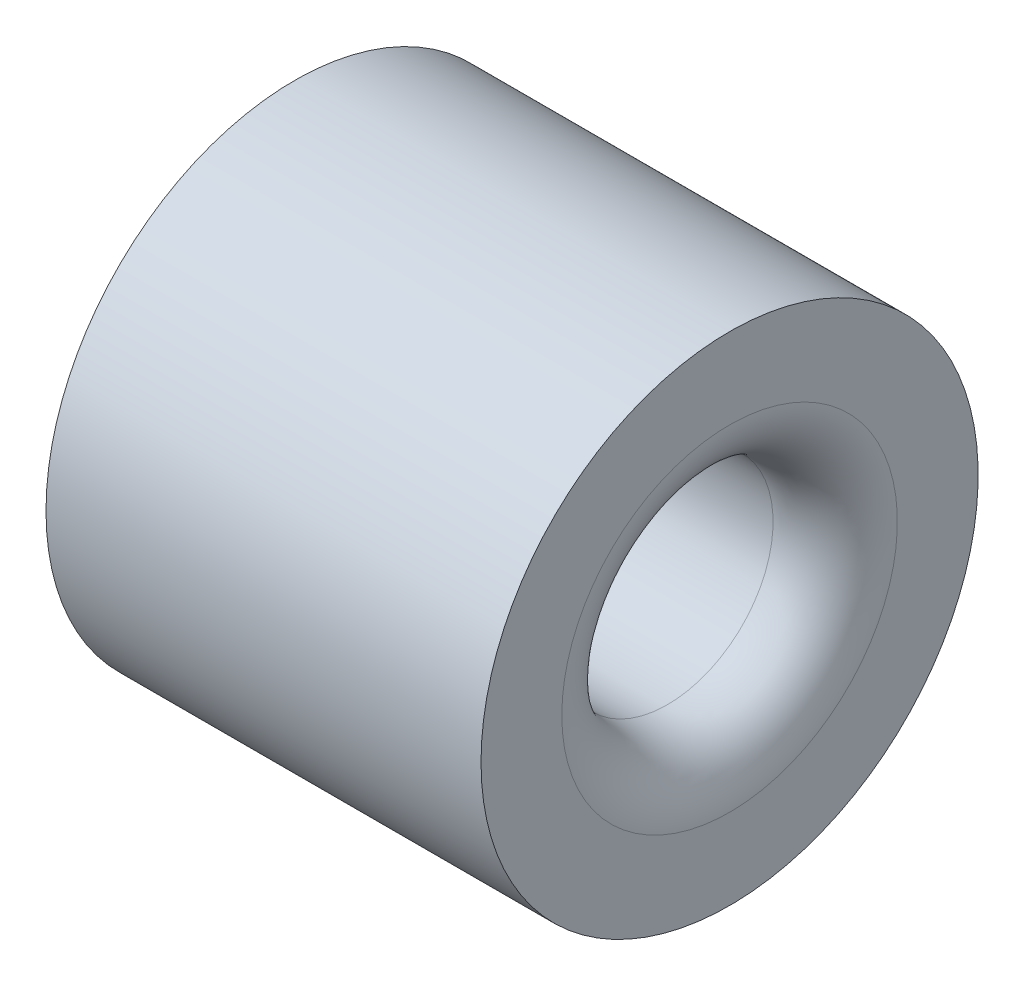
ISO-10303-21;
HEADER;
FILE_DESCRIPTION(('STEP AP214'),'2;1');
FILE_NAME('part.step','',(''),(''),'','','');
FILE_SCHEMA(('AUTOMOTIVE_DESIGN { 1 0 10303 214 1 1 1 1 }'));
ENDSEC;
DATA;
#1=APPLICATION_CONTEXT('core data for automotive mechanical design processes');
#2=APPLICATION_PROTOCOL_DEFINITION('international standard','automotive_design',2000,#1);
#3=PRODUCT_CONTEXT('',#1,'mechanical');
#4=PRODUCT('Part','Part','',(#3));
#5=PRODUCT_RELATED_PRODUCT_CATEGORY('part','',(#4));
#6=PRODUCT_DEFINITION_FORMATION('','',#4);
#7=PRODUCT_DEFINITION_CONTEXT('part definition',#1,'design');
#8=PRODUCT_DEFINITION('design','',#6,#7);
#9=PRODUCT_DEFINITION_SHAPE('','',#8);
#10=(LENGTH_UNIT() NAMED_UNIT(*) SI_UNIT(.MILLI.,.METRE.));
#11=(NAMED_UNIT(*) PLANE_ANGLE_UNIT() SI_UNIT($,.RADIAN.));
#12=(NAMED_UNIT(*) SI_UNIT($,.STERADIAN.) SOLID_ANGLE_UNIT());
#13=UNCERTAINTY_MEASURE_WITH_UNIT(LENGTH_MEASURE(1.E-05),#10,'distance_accuracy_value','');
#14=(GEOMETRIC_REPRESENTATION_CONTEXT(3) GLOBAL_UNCERTAINTY_ASSIGNED_CONTEXT((#13)) GLOBAL_UNIT_ASSIGNED_CONTEXT((#10,
#11,#12)) REPRESENTATION_CONTEXT('',''));
#15=CARTESIAN_POINT('',(0.,0.,0.));
#16=DIRECTION('',(0.,0.,1.));
#17=DIRECTION('',(1.,0.,0.));
#18=AXIS2_PLACEMENT_3D('',#15,#16,#17);
#19=CARTESIAN_POINT('',(0.,2.,0.));
#20=DIRECTION('',(1.,0.,0.));
#21=DIRECTION('',(0.,0.,-1.));
#22=AXIS2_PLACEMENT_3D('',#19,#20,#21);
#23=PLANE('',#22);
#24=CARTESIAN_POINT('',(0.,0.,0.));
#25=DIRECTION('',(1.,0.,0.));
#26=DIRECTION('',(0.,0.,-1.));
#27=AXIS2_PLACEMENT_3D('',#24,#25,#26);
#28=CIRCLE('',#27,1.35);
#29=CARTESIAN_POINT('',(0.,0.,-1.35));
#30=VERTEX_POINT('',#29);
#31=EDGE_CURVE('E39',#30,#30,#28,.T.);
#32=ORIENTED_EDGE('',*,*,#31,.T.);
#33=EDGE_LOOP('',(#32));
#34=FACE_BOUND('',#33,.T.);
#35=CARTESIAN_POINT('',(0.,0.,0.));
#36=DIRECTION('',(-1.,0.,0.));
#37=DIRECTION('',(0.,0.,1.));
#38=AXIS2_PLACEMENT_3D('',#35,#36,#37);
#39=CIRCLE('',#38,2.);
#40=CARTESIAN_POINT('',(0.,0.,2.));
#41=VERTEX_POINT('',#40);
#42=EDGE_CURVE('E55',#41,#41,#39,.T.);
#43=ORIENTED_EDGE('',*,*,#42,.T.);
#44=EDGE_LOOP('',(#43));
#45=FACE_BOUND('',#44,.T.);
#46=ADVANCED_FACE('F32',(#34,#45),#23,.F.);
#47=CARTESIAN_POINT('',(0.,0.,0.));
#48=DIRECTION('',(-1.,0.,0.));
#49=DIRECTION('',(0.,0.,1.));
#50=AXIS2_PLACEMENT_3D('',#47,#48,#49);
#51=CYLINDRICAL_SURFACE('',#50,0.85);
#52=CARTESIAN_POINT('',(0.5,0.,0.));
#53=DIRECTION('',(1.,0.,0.));
#54=DIRECTION('',(0.,0.,-1.));
#55=AXIS2_PLACEMENT_3D('',#52,#53,#54);
#56=CIRCLE('',#55,0.85);
#57=CARTESIAN_POINT('',(0.5,0.,-0.85));
#58=VERTEX_POINT('',#57);
#59=EDGE_CURVE('E43',#58,#58,#56,.F.);
#60=ORIENTED_EDGE('',*,*,#59,.T.);
#61=EDGE_LOOP('',(#60));
#62=FACE_BOUND('',#61,.T.);
#63=CARTESIAN_POINT('',(3.,0.,0.));
#64=DIRECTION('',(-1.,0.,0.));
#65=DIRECTION('',(0.,0.,1.));
#66=AXIS2_PLACEMENT_3D('',#63,#64,#65);
#67=CIRCLE('',#66,0.85);
#68=CARTESIAN_POINT('',(3.,0.,0.85));
#69=VERTEX_POINT('',#68);
#70=EDGE_CURVE('E47',#69,#69,#67,.F.);
#71=ORIENTED_EDGE('',*,*,#70,.T.);
#72=EDGE_LOOP('',(#71));
#73=FACE_BOUND('',#72,.T.);
#74=ADVANCED_FACE('F69',(#62,#73),#51,.F.);
#75=CARTESIAN_POINT('',(3.5,2.,0.));
#76=DIRECTION('',(-1.,0.,0.));
#77=DIRECTION('',(0.,0.,1.));
#78=AXIS2_PLACEMENT_3D('',#75,#76,#77);
#79=PLANE('',#78);
#80=CARTESIAN_POINT('',(3.5,0.,0.));
#81=DIRECTION('',(-1.,0.,0.));
#82=DIRECTION('',(0.,0.,1.));
#83=AXIS2_PLACEMENT_3D('',#80,#81,#82);
#84=CIRCLE('',#83,1.35);
#85=CARTESIAN_POINT('',(3.5,0.,1.35));
#86=VERTEX_POINT('',#85);
#87=EDGE_CURVE('E10',#86,#86,#84,.T.);
#88=ORIENTED_EDGE('',*,*,#87,.T.);
#89=EDGE_LOOP('',(#88));
#90=FACE_BOUND('',#89,.T.);
#91=CARTESIAN_POINT('',(3.5,0.,0.));
#92=DIRECTION('',(-1.,0.,0.));
#93=DIRECTION('',(0.,0.,1.));
#94=AXIS2_PLACEMENT_3D('',#91,#92,#93);
#95=CIRCLE('',#94,2.);
#96=CARTESIAN_POINT('',(3.5,0.,2.));
#97=VERTEX_POINT('',#96);
#98=EDGE_CURVE('E52',#97,#97,#95,.T.);
#99=ORIENTED_EDGE('',*,*,#98,.F.);
#100=EDGE_LOOP('',(#99));
#101=FACE_BOUND('',#100,.T.);
#102=ADVANCED_FACE('F64',(#90,#101),#79,.F.);
#103=CARTESIAN_POINT('',(0.,0.,0.));
#104=DIRECTION('',(-1.,0.,0.));
#105=DIRECTION('',(0.,0.,1.));
#106=AXIS2_PLACEMENT_3D('',#103,#104,#105);
#107=CYLINDRICAL_SURFACE('',#106,2.);
#108=ORIENTED_EDGE('',*,*,#42,.F.);
#109=EDGE_LOOP('',(#108));
#110=FACE_BOUND('',#109,.T.);
#111=ORIENTED_EDGE('',*,*,#98,.T.);
#112=EDGE_LOOP('',(#111));
#113=FACE_BOUND('',#112,.T.);
#114=ADVANCED_FACE('F60',(#110,#113),#107,.T.);
#115=CARTESIAN_POINT('',(0.5,0.,0.));
#116=DIRECTION('',(1.,0.,0.));
#117=DIRECTION('',(0.,0.,-1.));
#118=AXIS2_PLACEMENT_3D('',#115,#116,#117);
#119=TOROIDAL_SURFACE('',#118,1.35,0.5);
#120=ORIENTED_EDGE('',*,*,#31,.F.);
#121=EDGE_LOOP('',(#120));
#122=FACE_BOUND('',#121,.T.);
#123=ORIENTED_EDGE('',*,*,#59,.F.);
#124=EDGE_LOOP('',(#123));
#125=FACE_BOUND('',#124,.T.);
#126=ADVANCED_FACE('F63',(#122,#125),#119,.T.);
#127=CARTESIAN_POINT('',(3.,0.,0.));
#128=DIRECTION('',(-1.,0.,0.));
#129=DIRECTION('',(0.,0.,1.));
#130=AXIS2_PLACEMENT_3D('',#127,#128,#129);
#131=TOROIDAL_SURFACE('',#130,1.35,0.5);
#132=ORIENTED_EDGE('',*,*,#70,.F.);
#133=EDGE_LOOP('',(#132));
#134=FACE_BOUND('',#133,.T.);
#135=ORIENTED_EDGE('',*,*,#87,.F.);
#136=EDGE_LOOP('',(#135));
#137=FACE_BOUND('',#136,.T.);
#138=ADVANCED_FACE('F34',(#134,#137),#131,.T.);
#139=CLOSED_SHELL('',(#46,#74,#102,#114,#126,#138));
#140=MANIFOLD_SOLID_BREP('B2',#139);
#141=ADVANCED_BREP_SHAPE_REPRESENTATION('',(#18,#140),#14);
#142=SHAPE_DEFINITION_REPRESENTATION(#9,#141);
ENDSEC;
END-ISO-10303-21;
